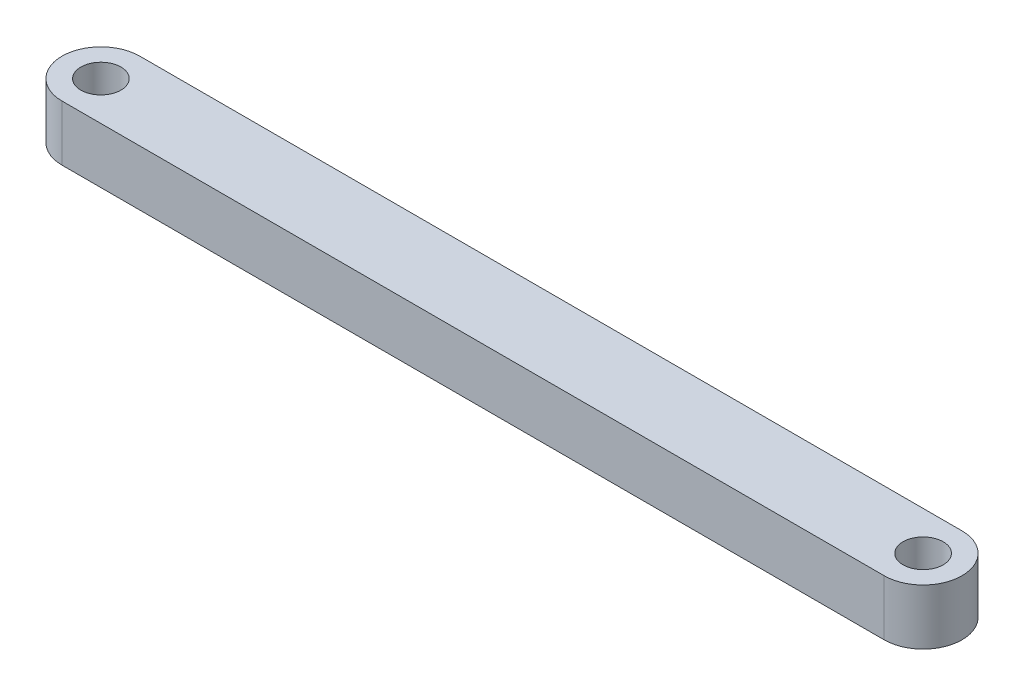
ISO-10303-21;
HEADER;
FILE_DESCRIPTION(('STEP AP214'),'2;1');
FILE_NAME('part.step','',(''),(''),'','','');
FILE_SCHEMA(('AUTOMOTIVE_DESIGN { 1 0 10303 214 1 1 1 1 }'));
ENDSEC;
DATA;
#1=APPLICATION_CONTEXT('core data for automotive mechanical design processes');
#2=APPLICATION_PROTOCOL_DEFINITION('international standard','automotive_design',2000,#1);
#3=PRODUCT_CONTEXT('',#1,'mechanical');
#4=PRODUCT('Part','Part','',(#3));
#5=PRODUCT_RELATED_PRODUCT_CATEGORY('part','',(#4));
#6=PRODUCT_DEFINITION_FORMATION('','',#4);
#7=PRODUCT_DEFINITION_CONTEXT('part definition',#1,'design');
#8=PRODUCT_DEFINITION('design','',#6,#7);
#9=PRODUCT_DEFINITION_SHAPE('','',#8);
#10=(LENGTH_UNIT() NAMED_UNIT(*) SI_UNIT(.MILLI.,.METRE.));
#11=(NAMED_UNIT(*) PLANE_ANGLE_UNIT() SI_UNIT($,.RADIAN.));
#12=(NAMED_UNIT(*) SI_UNIT($,.STERADIAN.) SOLID_ANGLE_UNIT());
#13=UNCERTAINTY_MEASURE_WITH_UNIT(LENGTH_MEASURE(1.E-05),#10,'distance_accuracy_value','');
#14=(GEOMETRIC_REPRESENTATION_CONTEXT(3) GLOBAL_UNCERTAINTY_ASSIGNED_CONTEXT((#13)) GLOBAL_UNIT_ASSIGNED_CONTEXT((#10,
#11,#12)) REPRESENTATION_CONTEXT('',''));
#15=CARTESIAN_POINT('',(0.,0.,0.));
#16=DIRECTION('',(0.,0.,1.));
#17=DIRECTION('',(1.,0.,0.));
#18=AXIS2_PLACEMENT_3D('',#15,#16,#17);
#19=CARTESIAN_POINT('',(4.445,6.35,-4.44499999999999));
#20=DIRECTION('',(0.,-1.,0.));
#21=DIRECTION('',(0.,0.,-1.));
#22=AXIS2_PLACEMENT_3D('',#19,#20,#21);
#23=PLANE('',#22);
#24=CARTESIAN_POINT('',(4.445,6.35,-4.44499999999999));
#25=DIRECTION('',(0.,1.,0.));
#26=DIRECTION('',(0.,0.,-1.));
#27=AXIS2_PLACEMENT_3D('',#24,#25,#26);
#28=CIRCLE('',#27,4.445);
#29=CARTESIAN_POINT('',(4.445,6.35,-8.88999999999998));
#30=VERTEX_POINT('',#29);
#31=CARTESIAN_POINT('',(4.445,6.35,0.));
#32=VERTEX_POINT('',#31);
#33=EDGE_CURVE('E85',#30,#32,#28,.T.);
#34=ORIENTED_EDGE('',*,*,#33,.T.);
#35=DIRECTION('',(1.,0.,0.));
#36=VECTOR('',#35,1.);
#37=CARTESIAN_POINT('',(98.425,6.35,0.));
#38=LINE('',#37,#36);
#39=CARTESIAN_POINT('',(98.425,6.35,0.));
#40=VERTEX_POINT('',#39);
#41=EDGE_CURVE('E80',#32,#40,#38,.T.);
#42=ORIENTED_EDGE('',*,*,#41,.T.);
#43=CARTESIAN_POINT('',(98.425,6.35,-4.445));
#44=DIRECTION('',(0.,1.,0.));
#45=DIRECTION('',(0.,0.,-1.));
#46=AXIS2_PLACEMENT_3D('',#43,#44,#45);
#47=CIRCLE('',#46,4.44499999999999);
#48=CARTESIAN_POINT('',(98.425,6.35,-8.88999999999998));
#49=VERTEX_POINT('',#48);
#50=EDGE_CURVE('E83',#40,#49,#47,.T.);
#51=ORIENTED_EDGE('',*,*,#50,.T.);
#52=DIRECTION('',(-1.,0.,0.));
#53=VECTOR('',#52,1.);
#54=CARTESIAN_POINT('',(4.445,6.35,-8.88999999999998));
#55=LINE('',#54,#53);
#56=EDGE_CURVE('E50',#49,#30,#55,.T.);
#57=ORIENTED_EDGE('',*,*,#56,.T.);
#58=EDGE_LOOP('',(#34,#42,#51,#57));
#59=FACE_BOUND('',#58,.T.);
#60=CARTESIAN_POINT('',(4.445,6.35,-4.44499999999999));
#61=DIRECTION('',(0.,1.,0.));
#62=DIRECTION('',(0.,0.,1.));
#63=AXIS2_PLACEMENT_3D('',#60,#61,#62);
#64=CIRCLE('',#63,2.29235);
#65=CARTESIAN_POINT('',(4.445,6.35,-2.15264999999999));
#66=VERTEX_POINT('',#65);
#67=EDGE_CURVE('E100',#66,#66,#64,.T.);
#68=ORIENTED_EDGE('',*,*,#67,.F.);
#69=EDGE_LOOP('',(#68));
#70=FACE_BOUND('',#69,.T.);
#71=CARTESIAN_POINT('',(98.425,6.35,-4.445));
#72=DIRECTION('',(0.,1.,0.));
#73=DIRECTION('',(0.,0.,1.));
#74=AXIS2_PLACEMENT_3D('',#71,#72,#73);
#75=CIRCLE('',#74,2.29235);
#76=CARTESIAN_POINT('',(98.425,6.35,-2.15265));
#77=VERTEX_POINT('',#76);
#78=EDGE_CURVE('E115',#77,#77,#75,.T.);
#79=ORIENTED_EDGE('',*,*,#78,.F.);
#80=EDGE_LOOP('',(#79));
#81=FACE_BOUND('',#80,.T.);
#82=ADVANCED_FACE('F33',(#59,#70,#81),#23,.F.);
#83=CARTESIAN_POINT('',(4.445,0.,-4.44499999999999));
#84=DIRECTION('',(0.,-1.,0.));
#85=DIRECTION('',(0.,0.,-1.));
#86=AXIS2_PLACEMENT_3D('',#83,#84,#85);
#87=PLANE('',#86);
#88=CARTESIAN_POINT('',(4.445,0.,-4.44499999999999));
#89=DIRECTION('',(0.,1.,0.));
#90=DIRECTION('',(0.,0.,1.));
#91=AXIS2_PLACEMENT_3D('',#88,#89,#90);
#92=CIRCLE('',#91,2.29235);
#93=CARTESIAN_POINT('',(4.445,0.,-2.15264999999999));
#94=VERTEX_POINT('',#93);
#95=EDGE_CURVE('E112',#94,#94,#92,.T.);
#96=ORIENTED_EDGE('',*,*,#95,.T.);
#97=EDGE_LOOP('',(#96));
#98=FACE_BOUND('',#97,.T.);
#99=CARTESIAN_POINT('',(4.445,0.,-4.44499999999999));
#100=DIRECTION('',(0.,1.,0.));
#101=DIRECTION('',(0.,0.,-1.));
#102=AXIS2_PLACEMENT_3D('',#99,#100,#101);
#103=CIRCLE('',#102,4.445);
#104=CARTESIAN_POINT('',(4.445,0.,-8.88999999999998));
#105=VERTEX_POINT('',#104);
#106=CARTESIAN_POINT('',(4.445,0.,0.));
#107=VERTEX_POINT('',#106);
#108=EDGE_CURVE('E97',#105,#107,#103,.T.);
#109=ORIENTED_EDGE('',*,*,#108,.F.);
#110=DIRECTION('',(-1.,0.,0.));
#111=VECTOR('',#110,1.);
#112=CARTESIAN_POINT('',(4.445,0.,-8.88999999999998));
#113=LINE('',#112,#111);
#114=CARTESIAN_POINT('',(98.425,0.,-8.88999999999998));
#115=VERTEX_POINT('',#114);
#116=EDGE_CURVE('E73',#115,#105,#113,.T.);
#117=ORIENTED_EDGE('',*,*,#116,.F.);
#118=CARTESIAN_POINT('',(98.425,0.,-4.445));
#119=DIRECTION('',(0.,1.,0.));
#120=DIRECTION('',(0.,0.,-1.));
#121=AXIS2_PLACEMENT_3D('',#118,#119,#120);
#122=CIRCLE('',#121,4.44499999999999);
#123=CARTESIAN_POINT('',(98.425,0.,0.));
#124=VERTEX_POINT('',#123);
#125=EDGE_CURVE('E67',#124,#115,#122,.T.);
#126=ORIENTED_EDGE('',*,*,#125,.F.);
#127=DIRECTION('',(1.,0.,0.));
#128=VECTOR('',#127,1.);
#129=CARTESIAN_POINT('',(98.425,0.,0.));
#130=LINE('',#129,#128);
#131=EDGE_CURVE('E89',#107,#124,#130,.T.);
#132=ORIENTED_EDGE('',*,*,#131,.F.);
#133=EDGE_LOOP('',(#109,#117,#126,#132));
#134=FACE_BOUND('',#133,.T.);
#135=CARTESIAN_POINT('',(98.425,0.,-4.445));
#136=DIRECTION('',(0.,1.,0.));
#137=DIRECTION('',(0.,0.,1.));
#138=AXIS2_PLACEMENT_3D('',#135,#136,#137);
#139=CIRCLE('',#138,2.29235);
#140=CARTESIAN_POINT('',(98.425,0.,-2.15265));
#141=VERTEX_POINT('',#140);
#142=EDGE_CURVE('E118',#141,#141,#139,.T.);
#143=ORIENTED_EDGE('',*,*,#142,.T.);
#144=EDGE_LOOP('',(#143));
#145=FACE_BOUND('',#144,.T.);
#146=ADVANCED_FACE('F108',(#98,#134,#145),#87,.T.);
#147=CARTESIAN_POINT('',(4.445,6.35,-4.44499999999999));
#148=DIRECTION('',(0.,-1.,0.));
#149=DIRECTION('',(0.,0.,-1.));
#150=AXIS2_PLACEMENT_3D('',#147,#148,#149);
#151=CYLINDRICAL_SURFACE('',#150,4.445);
#152=ORIENTED_EDGE('',*,*,#108,.T.);
#153=DIRECTION('',(0.,-1.,0.));
#154=VECTOR('',#153,1.);
#155=CARTESIAN_POINT('',(4.445,6.35,0.));
#156=LINE('',#155,#154);
#157=EDGE_CURVE('E11',#32,#107,#156,.T.);
#158=ORIENTED_EDGE('',*,*,#157,.F.);
#159=ORIENTED_EDGE('',*,*,#33,.F.);
#160=DIRECTION('',(0.,-1.,0.));
#161=VECTOR('',#160,1.);
#162=CARTESIAN_POINT('',(4.445,6.35,-8.88999999999998));
#163=LINE('',#162,#161);
#164=EDGE_CURVE('E93',#30,#105,#163,.T.);
#165=ORIENTED_EDGE('',*,*,#164,.T.);
#166=EDGE_LOOP('',(#152,#158,#159,#165));
#167=FACE_BOUND('',#166,.T.);
#168=ADVANCED_FACE('F35',(#167),#151,.T.);
#169=CARTESIAN_POINT('',(98.425,6.35,0.));
#170=DIRECTION('',(0.,0.,-1.));
#171=DIRECTION('',(-1.,0.,0.));
#172=AXIS2_PLACEMENT_3D('',#169,#170,#171);
#173=PLANE('',#172);
#174=ORIENTED_EDGE('',*,*,#131,.T.);
#175=DIRECTION('',(0.,-1.,0.));
#176=VECTOR('',#175,1.);
#177=CARTESIAN_POINT('',(98.425,6.35,0.));
#178=LINE('',#177,#176);
#179=EDGE_CURVE('E42',#40,#124,#178,.T.);
#180=ORIENTED_EDGE('',*,*,#179,.F.);
#181=ORIENTED_EDGE('',*,*,#41,.F.);
#182=ORIENTED_EDGE('',*,*,#157,.T.);
#183=EDGE_LOOP('',(#174,#180,#181,#182));
#184=FACE_BOUND('',#183,.T.);
#185=ADVANCED_FACE('F88',(#184),#173,.F.);
#186=CARTESIAN_POINT('',(98.425,6.35,-4.445));
#187=DIRECTION('',(0.,-1.,0.));
#188=DIRECTION('',(0.,0.,-1.));
#189=AXIS2_PLACEMENT_3D('',#186,#187,#188);
#190=CYLINDRICAL_SURFACE('',#189,4.44499999999999);
#191=ORIENTED_EDGE('',*,*,#125,.T.);
#192=DIRECTION('',(0.,-1.,0.));
#193=VECTOR('',#192,1.);
#194=CARTESIAN_POINT('',(98.425,6.35,-8.88999999999998));
#195=LINE('',#194,#193);
#196=EDGE_CURVE('E90',#49,#115,#195,.T.);
#197=ORIENTED_EDGE('',*,*,#196,.F.);
#198=ORIENTED_EDGE('',*,*,#50,.F.);
#199=ORIENTED_EDGE('',*,*,#179,.T.);
#200=EDGE_LOOP('',(#191,#197,#198,#199));
#201=FACE_BOUND('',#200,.T.);
#202=ADVANCED_FACE('F91',(#201),#190,.T.);
#203=CARTESIAN_POINT('',(4.445,6.35,-8.88999999999998));
#204=DIRECTION('',(0.,0.,1.));
#205=DIRECTION('',(1.,0.,0.));
#206=AXIS2_PLACEMENT_3D('',#203,#204,#205);
#207=PLANE('',#206);
#208=ORIENTED_EDGE('',*,*,#116,.T.);
#209=ORIENTED_EDGE('',*,*,#164,.F.);
#210=ORIENTED_EDGE('',*,*,#56,.F.);
#211=ORIENTED_EDGE('',*,*,#196,.T.);
#212=EDGE_LOOP('',(#208,#209,#210,#211));
#213=FACE_BOUND('',#212,.T.);
#214=ADVANCED_FACE('F105',(#213),#207,.F.);
#215=CARTESIAN_POINT('',(4.445,6.35,-4.44499999999999));
#216=DIRECTION('',(0.,-1.,0.));
#217=DIRECTION('',(0.,0.,-1.));
#218=AXIS2_PLACEMENT_3D('',#215,#216,#217);
#219=CYLINDRICAL_SURFACE('',#218,2.29235);
#220=ORIENTED_EDGE('',*,*,#67,.T.);
#221=EDGE_LOOP('',(#220));
#222=FACE_BOUND('',#221,.T.);
#223=ORIENTED_EDGE('',*,*,#95,.F.);
#224=EDGE_LOOP('',(#223));
#225=FACE_BOUND('',#224,.T.);
#226=ADVANCED_FACE('F135',(#222,#225),#219,.F.);
#227=CARTESIAN_POINT('',(98.425,6.35,-4.445));
#228=DIRECTION('',(0.,-1.,0.));
#229=DIRECTION('',(0.,0.,-1.));
#230=AXIS2_PLACEMENT_3D('',#227,#228,#229);
#231=CYLINDRICAL_SURFACE('',#230,2.29235);
#232=ORIENTED_EDGE('',*,*,#78,.T.);
#233=EDGE_LOOP('',(#232));
#234=FACE_BOUND('',#233,.T.);
#235=ORIENTED_EDGE('',*,*,#142,.F.);
#236=EDGE_LOOP('',(#235));
#237=FACE_BOUND('',#236,.T.);
#238=ADVANCED_FACE('F124',(#234,#237),#231,.F.);
#239=CLOSED_SHELL('',(#82,#146,#168,#185,#202,#214,#226,#238));
#240=MANIFOLD_SOLID_BREP('B2',#239);
#241=ADVANCED_BREP_SHAPE_REPRESENTATION('',(#18,#240),#14);
#242=SHAPE_DEFINITION_REPRESENTATION(#9,#241);
ENDSEC;
END-ISO-10303-21;
